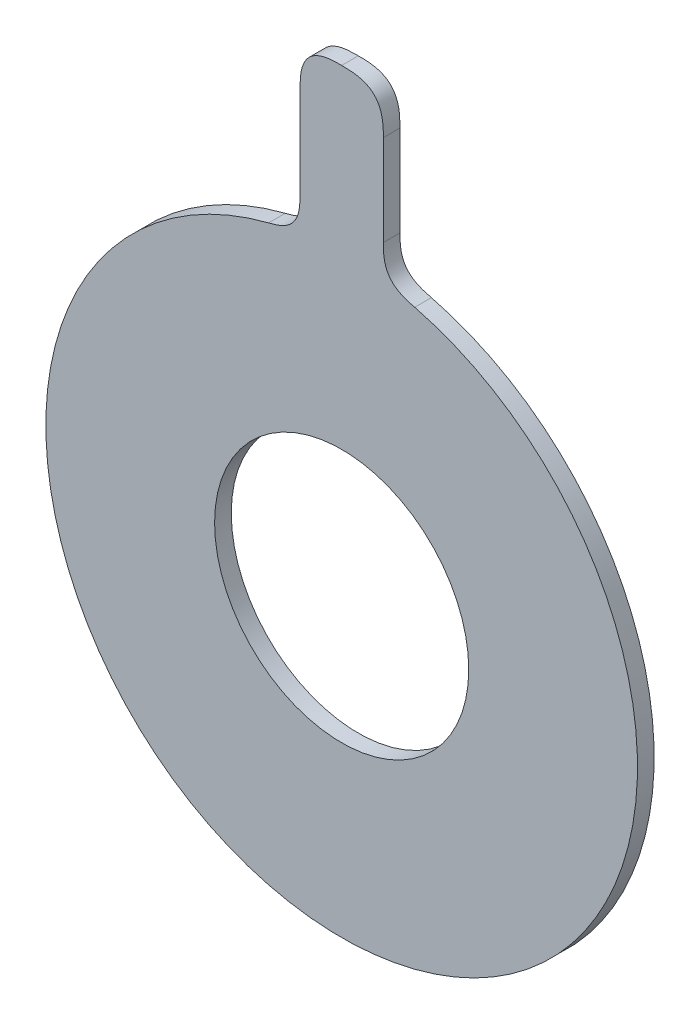
ISO-10303-21;
HEADER;
FILE_DESCRIPTION(('STEP AP214'),'2;1');
FILE_NAME('part.step','',(''),(''),'','','');
FILE_SCHEMA(('AUTOMOTIVE_DESIGN { 1 0 10303 214 1 1 1 1 }'));
ENDSEC;
DATA;
#1=APPLICATION_CONTEXT('core data for automotive mechanical design processes');
#2=APPLICATION_PROTOCOL_DEFINITION('international standard','automotive_design',2000,#1);
#3=PRODUCT_CONTEXT('',#1,'mechanical');
#4=PRODUCT('Part','Part','',(#3));
#5=PRODUCT_RELATED_PRODUCT_CATEGORY('part','',(#4));
#6=PRODUCT_DEFINITION_FORMATION('','',#4);
#7=PRODUCT_DEFINITION_CONTEXT('part definition',#1,'design');
#8=PRODUCT_DEFINITION('design','',#6,#7);
#9=PRODUCT_DEFINITION_SHAPE('','',#8);
#10=(LENGTH_UNIT() NAMED_UNIT(*) SI_UNIT(.MILLI.,.METRE.));
#11=(NAMED_UNIT(*) PLANE_ANGLE_UNIT() SI_UNIT($,.RADIAN.));
#12=(NAMED_UNIT(*) SI_UNIT($,.STERADIAN.) SOLID_ANGLE_UNIT());
#13=UNCERTAINTY_MEASURE_WITH_UNIT(LENGTH_MEASURE(1.E-05),#10,'distance_accuracy_value','');
#14=(GEOMETRIC_REPRESENTATION_CONTEXT(3) GLOBAL_UNCERTAINTY_ASSIGNED_CONTEXT((#13)) GLOBAL_UNIT_ASSIGNED_CONTEXT((#10,
#11,#12)) REPRESENTATION_CONTEXT('',''));
#15=CARTESIAN_POINT('',(0.,0.,0.));
#16=DIRECTION('',(0.,0.,1.));
#17=DIRECTION('',(1.,0.,0.));
#18=AXIS2_PLACEMENT_3D('',#15,#16,#17);
#19=CARTESIAN_POINT('',(0.,2.22044604925031E-13,2.));
#20=DIRECTION('',(0.,0.,-1.));
#21=DIRECTION('',(-1.,0.,0.));
#22=AXIS2_PLACEMENT_3D('',#19,#20,#21);
#23=CYLINDRICAL_SURFACE('',#22,35.5);
#24=CARTESIAN_POINT('',(0.,2.22044604925031E-13,2.));
#25=DIRECTION('',(0.,0.,1.));
#26=DIRECTION('',(1.,0.,0.));
#27=AXIS2_PLACEMENT_3D('',#24,#25,#26);
#28=CIRCLE('',#27,35.5);
#29=CARTESIAN_POINT('',(-8.76543209876557,34.4008313870746,2.00000000000045));
#30=VERTEX_POINT('',#29);
#31=CARTESIAN_POINT('',(8.76543209876512,34.4008313870744,2.));
#32=VERTEX_POINT('',#31);
#33=EDGE_CURVE('E171',#30,#32,#28,.T.);
#34=ORIENTED_EDGE('',*,*,#33,.F.);
#35=CARTESIAN_POINT('',(-8.76543209876554,34.4008313870747,-0.0999999999995449));
#36=CARTESIAN_POINT('',(-8.76543209876555,34.4008313870747,0.633333333333819));
#37=CARTESIAN_POINT('',(-8.76543209876557,34.4008313870747,1.36666666666752));
#38=CARTESIAN_POINT('',(-8.76543209876553,34.4008313870746,2.09999999999816));
#39=B_SPLINE_CURVE_WITH_KNOTS('',3,(#35,#36,#37,#38),.UNSPECIFIED.,.F.,.F.,(4,4),
(-9.99999999999998E-05,0.0021),.UNSPECIFIED.);
#40=CARTESIAN_POINT('',(-8.76543209876555,34.4008313870747,4.44089209850063E-13));
#41=VERTEX_POINT('',#40);
#42=EDGE_CURVE('E421',#30,#41,#39,.F.);
#43=ORIENTED_EDGE('',*,*,#42,.T.);
#44=CARTESIAN_POINT('',(0.,0.,0.));
#45=DIRECTION('',(0.,0.,1.));
#46=DIRECTION('',(1.,0.,0.));
#47=AXIS2_PLACEMENT_3D('',#44,#45,#46);
#48=CIRCLE('',#47,35.5);
#49=CARTESIAN_POINT('',(8.76543209876521,34.4008313870745,0.));
#50=VERTEX_POINT('',#49);
#51=EDGE_CURVE('E156',#41,#50,#48,.T.);
#52=ORIENTED_EDGE('',*,*,#51,.T.);
#53=CARTESIAN_POINT('',(8.76543209876518,34.4008313870744,2.0999999999986));
#54=CARTESIAN_POINT('',(8.76543209876512,34.4008313870745,1.36666666666707));
#55=CARTESIAN_POINT('',(8.76543209876521,34.4008313870745,0.633333333333375));
#56=CARTESIAN_POINT('',(8.76543209876515,34.4008313870745,-0.099999999999989));
#57=B_SPLINE_CURVE_WITH_KNOTS('',3,(#53,#54,#55,#56),.UNSPECIFIED.,.F.,.F.,(4,4),(-0.0001,
0.0021),.UNSPECIFIED.);
#58=EDGE_CURVE('E71',#50,#32,#57,.F.);
#59=ORIENTED_EDGE('',*,*,#58,.T.);
#60=EDGE_LOOP('',(#34,#43,#52,#59));
#61=FACE_BOUND('',#60,.T.);
#62=ADVANCED_FACE('F40',(#61),#23,.T.);
#63=CARTESIAN_POINT('',(0.,2.22044604925031E-13,2.));
#64=DIRECTION('',(0.,0.,1.));
#65=DIRECTION('',(1.,0.,0.));
#66=AXIS2_PLACEMENT_3D('',#63,#64,#65);
#67=PLANE('',#66);
#68=DIRECTION('',(0.,1.,0.));
#69=VECTOR('',#68,1.);
#70=CARTESIAN_POINT('',(4.99999999999939,35.1461235415802,2.00000000000033));
#71=LINE('',#70,#69);
#72=CARTESIAN_POINT('',(4.99999999999987,39.246018906381,2.00000000000011));
#73=VERTEX_POINT('',#72);
#74=CARTESIAN_POINT('',(4.99999999999984,50.1461235415829,2.));
#75=VERTEX_POINT('',#74);
#76=EDGE_CURVE('E129',#73,#75,#71,.T.);
#77=ORIENTED_EDGE('',*,*,#76,.T.);
#78=CARTESIAN_POINT('',(-1.53646452352103E-12,55.1461235415829,1.9999999999989));
#79=CARTESIAN_POINT('',(0.840990257668321,55.146123541582,1.9999999999989));
#80=CARTESIAN_POINT('',(1.68198051533819,55.1461235415804,1.99999999999882));
#81=CARTESIAN_POINT('',(3.53553390593263,54.7876639424003,1.99999999999879));
#82=CARTESIAN_POINT('',(4.64154040081864,53.6816574475131,1.99999999999875));
#83=CARTESIAN_POINT('',(4.99999999999973,51.8281040569224,1.99999999999874));
#84=CARTESIAN_POINT('',(4.99999999999938,50.9871137992527,1.99999999999874));
#85=CARTESIAN_POINT('',(4.99999999999985,50.1461235415829,1.99999999999879));
#86=B_SPLINE_CURVE_WITH_KNOTS('',5,(#78,#79,#80,#81,#82,#83,#84,#85),.UNSPECIFIED.,.F.,.F.,(6,2,
6),(0.,0.5,1.),.UNSPECIFIED.);
#87=CARTESIAN_POINT('',(-1.4883927423881E-12,55.1461235415829,2.00000000000011));
#88=VERTEX_POINT('',#87);
#89=EDGE_CURVE('E62',#75,#88,#86,.F.);
#90=ORIENTED_EDGE('',*,*,#89,.T.);
#91=CARTESIAN_POINT('',(-4.99999999999991,50.1461235415822,1.99999999999846));
#92=CARTESIAN_POINT('',(-5.00000000000038,50.9871137992519,1.99999999999846));
#93=CARTESIAN_POINT('',(-5.00000000000051,51.8281040569217,1.99999999999847));
#94=CARTESIAN_POINT('',(-4.6415404008205,53.6816574475159,1.99999999999851));
#95=CARTESIAN_POINT('',(-3.53553390593316,54.7876639424019,1.99999999999847));
#96=CARTESIAN_POINT('',(-1.68198051534068,55.1461235415829,1.99999999999914));
#97=CARTESIAN_POINT('',(-0.840990257671352,55.1461235415831,1.99999999999882));
#98=CARTESIAN_POINT('',(-1.53646452352103E-12,55.1461235415829,1.9999999999989));
#99=B_SPLINE_CURVE_WITH_KNOTS('',5,(#91,#92,#93,#94,#95,#96,#97,#98),.UNSPECIFIED.,.F.,.F.,(6,2,
6),(0.,0.5,1.),.UNSPECIFIED.);
#100=CARTESIAN_POINT('',(-4.99999999999995,50.1461235415822,2.00000000000045));
#101=VERTEX_POINT('',#100);
#102=EDGE_CURVE('E178',#88,#101,#99,.F.);
#103=ORIENTED_EDGE('',*,*,#102,.T.);
#104=DIRECTION('',(0.,-1.,0.));
#105=VECTOR('',#104,1.);
#106=CARTESIAN_POINT('',(-5.00000000000039,35.1461235415809,2.00000000000045));
#107=LINE('',#106,#105);
#108=CARTESIAN_POINT('',(-5.00000000000028,39.2460189063817,2.00000000000045));
#109=VERTEX_POINT('',#108);
#110=EDGE_CURVE('E140',#101,#109,#107,.T.);
#111=ORIENTED_EDGE('',*,*,#110,.T.);
#112=CARTESIAN_POINT('',(-8.76543209876553,34.4008313870746,1.99999999999846));
#113=CARTESIAN_POINT('',(-8.14815903699597,34.5581143622581,1.99999999999847));
#114=CARTESIAN_POINT('',(-7.50623307055207,34.7069349955398,1.99999999999845));
#115=CARTESIAN_POINT('',(-6.03905587624584,35.323981186758,1.99999999999847));
#116=CARTESIAN_POINT('',(-5.22960509826433,36.4057303778186,1.99999999999847));
#117=CARTESIAN_POINT('',(-4.99999999999993,37.8916576407777,1.99999999999851));
#118=CARTESIAN_POINT('',(-5.0000000000013,38.5688382735797,1.99999999999846));
#119=CARTESIAN_POINT('',(-5.00000000000034,39.2460189063817,1.99999999999852));
#120=B_SPLINE_CURVE_WITH_KNOTS('',5,(#112,#113,#114,#115,#116,#117,#118,#119),.UNSPECIFIED.,.F.,
.F.,(6,2,6),(0.,0.5,1.),.UNSPECIFIED.);
#121=EDGE_CURVE('E118',#109,#30,#120,.F.);
#122=ORIENTED_EDGE('',*,*,#121,.T.);
#123=ORIENTED_EDGE('',*,*,#33,.T.);
#124=CARTESIAN_POINT('',(4.99999999999986,39.246018906381,1.9999999999988));
#125=CARTESIAN_POINT('',(4.9999999999984,38.568838273579,1.9999999999988));
#126=CARTESIAN_POINT('',(4.99999999999986,37.8916576407771,1.99999999999893));
#127=CARTESIAN_POINT('',(5.22960509826383,36.4057303778193,1.99999999999912));
#128=CARTESIAN_POINT('',(6.03905587624529,35.3239811867576,1.9999999999989));
#129=CARTESIAN_POINT('',(7.50623307055017,34.7069349955418,1.99999999999885));
#130=CARTESIAN_POINT('',(8.14815903699486,34.5581143622582,1.99999999999874));
#131=CARTESIAN_POINT('',(8.76543209876517,34.4008313870744,1.99999999999879));
#132=B_SPLINE_CURVE_WITH_KNOTS('',5,(#124,#125,#126,#127,#128,#129,#130,#131),.UNSPECIFIED.,.F.,
.F.,(6,2,6),(0.,0.5,1.),.UNSPECIFIED.);
#133=EDGE_CURVE('E11',#32,#73,#132,.F.);
#134=ORIENTED_EDGE('',*,*,#133,.T.);
#135=EDGE_LOOP('',(#77,#90,#103,#111,#122,#123,#134));
#136=FACE_BOUND('',#135,.T.);
#137=CARTESIAN_POINT('',(0.,2.22044604925031E-13,2.));
#138=DIRECTION('',(0.,0.,1.));
#139=DIRECTION('',(1.,0.,0.));
#140=AXIS2_PLACEMENT_3D('',#137,#138,#139);
#141=CIRCLE('',#140,15.25);
#142=CARTESIAN_POINT('',(15.25,2.23102783908205E-13,2.));
#143=VERTEX_POINT('',#142);
#144=EDGE_CURVE('E162',#143,#143,#141,.T.);
#145=ORIENTED_EDGE('',*,*,#144,.F.);
#146=EDGE_LOOP('',(#145));
#147=FACE_BOUND('',#146,.T.);
#148=ADVANCED_FACE('F184',(#136,#147),#67,.T.);
#149=CARTESIAN_POINT('',(0.,0.,0.));
#150=DIRECTION('',(0.,0.,1.));
#151=DIRECTION('',(1.,0.,0.));
#152=AXIS2_PLACEMENT_3D('',#149,#150,#151);
#153=PLANE('',#152);
#154=CARTESIAN_POINT('',(-1.07456670241947E-12,55.1461235415829,1.26187580350157E-13));
#155=CARTESIAN_POINT('',(-0.84099025767089,55.1461235415831,1.54431046943404E-13));
#156=CARTESIAN_POINT('',(-1.68198051534032,55.146123541583,4.5923415894697E-13));
#157=CARTESIAN_POINT('',(-3.53553390593313,54.787663942402,4.59837246405415E-13));
#158=CARTESIAN_POINT('',(-4.64154040082047,53.6816574475159,4.72976421483223E-13));
#159=CARTESIAN_POINT('',(-5.00000000000043,51.8281040569217,4.59837246405415E-13));
#160=CARTESIAN_POINT('',(-5.00000000000089,50.9871137992519,5.69531401206635E-13));
#161=CARTESIAN_POINT('',(-4.99999999999992,50.1461235415822,4.72976421483223E-13));
#162=B_SPLINE_CURVE_WITH_KNOTS('',5,(#154,#155,#156,#157,#158,#159,#160,#161),.UNSPECIFIED.,.F.,
.F.,(6,2,6),(0.,0.5,1.),.UNSPECIFIED.);
#163=CARTESIAN_POINT('',(-4.99999999999988,50.1461235415822,4.44089209850063E-13));
#164=VERTEX_POINT('',#163);
#165=CARTESIAN_POINT('',(-1.07205910815367E-12,55.1461235415829,1.11022302462516E-13));
#166=VERTEX_POINT('',#165);
#167=EDGE_CURVE('E174',#164,#166,#162,.F.);
#168=ORIENTED_EDGE('',*,*,#167,.T.);
#169=CARTESIAN_POINT('',(4.99999999999987,50.1461235415829,0.));
#170=CARTESIAN_POINT('',(4.99999999999939,50.9871137992527,0.));
#171=CARTESIAN_POINT('',(4.99999999999983,51.8281040569224,0.));
#172=CARTESIAN_POINT('',(4.64154040081865,53.6816574475131,0.));
#173=CARTESIAN_POINT('',(3.53553390593265,54.7876639424002,0.));
#174=CARTESIAN_POINT('',(1.68198051533851,55.1461235415805,1.26838101653648E-13));
#175=CARTESIAN_POINT('',(0.840990257668693,55.1461235415821,2.22749336337147E-13));
#176=CARTESIAN_POINT('',(-1.07456670241947E-12,55.1461235415829,1.26187580350157E-13));
#177=B_SPLINE_CURVE_WITH_KNOTS('',5,(#169,#170,#171,#172,#173,#174,#175,#176),.UNSPECIFIED.,.F.,
.F.,(6,2,6),(0.,0.5,1.),.UNSPECIFIED.);
#178=CARTESIAN_POINT('',(4.99999999999992,50.1461235415829,0.));
#179=VERTEX_POINT('',#178);
#180=EDGE_CURVE('E132',#166,#179,#177,.F.);
#181=ORIENTED_EDGE('',*,*,#180,.T.);
#182=DIRECTION('',(0.,1.,0.));
#183=VECTOR('',#182,1.);
#184=CARTESIAN_POINT('',(4.99999999999987,35.1461235415802,3.33066907387547E-13));
#185=LINE('',#184,#183);
#186=CARTESIAN_POINT('',(4.99999999999992,39.246018906381,1.11022302462516E-13));
#187=VERTEX_POINT('',#186);
#188=EDGE_CURVE('E127',#187,#179,#185,.T.);
#189=ORIENTED_EDGE('',*,*,#188,.F.);
#190=CARTESIAN_POINT('',(8.76543209876516,34.4008313870745,0.));
#191=CARTESIAN_POINT('',(8.1481590369949,34.5581143622582,0.));
#192=CARTESIAN_POINT('',(7.50623307055016,34.7069349955419,2.22749336337147E-13));
#193=CARTESIAN_POINT('',(6.03905587624535,35.3239811867576,2.22749336337147E-13));
#194=CARTESIAN_POINT('',(5.22960509826289,36.4057303778194,3.48232185275188E-13));
#195=CARTESIAN_POINT('',(4.99999999999989,37.8916576407771,3.48211856484454E-13));
#196=CARTESIAN_POINT('',(4.99999999999848,38.568838273579,1.26180804086579E-13));
#197=CARTESIAN_POINT('',(4.99999999999992,39.246018906381,1.26180804086579E-13));
#198=B_SPLINE_CURVE_WITH_KNOTS('',5,(#190,#191,#192,#193,#194,#195,#196,#197),.UNSPECIFIED.,.F.,
.F.,(6,2,6),(0.,0.5,1.),.UNSPECIFIED.);
#199=EDGE_CURVE('E55',#187,#50,#198,.F.);
#200=ORIENTED_EDGE('',*,*,#199,.T.);
#201=ORIENTED_EDGE('',*,*,#51,.F.);
#202=CARTESIAN_POINT('',(-5.00000000000025,39.2460189063816,4.59844022668993E-13));
#203=CARTESIAN_POINT('',(-5.00000000000131,38.5688382735797,4.72976421483223E-13));
#204=CARTESIAN_POINT('',(-4.9999999999999,37.8916576407777,4.59166396311189E-13));
#205=CARTESIAN_POINT('',(-5.22960509826571,36.4057303778187,4.59837246405415E-13));
#206=CARTESIAN_POINT('',(-6.03905587624576,35.3239811867581,4.59837246405415E-13));
#207=CARTESIAN_POINT('',(-7.50623307055199,34.7069349955399,4.58515875007698E-13));
#208=CARTESIAN_POINT('',(-8.14815903699598,34.5581143622581,4.59837246405415E-13));
#209=CARTESIAN_POINT('',(-8.76543209876554,34.4008313870747,4.59159620047611E-13));
#210=B_SPLINE_CURVE_WITH_KNOTS('',5,(#202,#203,#204,#205,#206,#207,#208,#209),.UNSPECIFIED.,.F.,
.F.,(6,2,6),(0.,0.5,1.),.UNSPECIFIED.);
#211=CARTESIAN_POINT('',(-5.00000000000031,39.2460189063817,4.44089209850063E-13));
#212=VERTEX_POINT('',#211);
#213=EDGE_CURVE('E328',#41,#212,#210,.F.);
#214=ORIENTED_EDGE('',*,*,#213,.T.);
#215=DIRECTION('',(0.,-1.,0.));
#216=VECTOR('',#215,1.);
#217=CARTESIAN_POINT('',(-4.99999999999992,35.1461235415809,4.44089209850063E-13));
#218=LINE('',#217,#216);
#219=EDGE_CURVE('E141',#164,#212,#218,.T.);
#220=ORIENTED_EDGE('',*,*,#219,.F.);
#221=EDGE_LOOP('',(#168,#181,#189,#200,#201,#214,#220));
#222=FACE_BOUND('',#221,.T.);
#223=CARTESIAN_POINT('',(0.,0.,0.));
#224=DIRECTION('',(0.,0.,1.));
#225=DIRECTION('',(1.,0.,0.));
#226=AXIS2_PLACEMENT_3D('',#223,#224,#225);
#227=CIRCLE('',#226,15.25);
#228=CARTESIAN_POINT('',(15.25,0.,0.));
#229=VERTEX_POINT('',#228);
#230=EDGE_CURVE('E166',#229,#229,#227,.T.);
#231=ORIENTED_EDGE('',*,*,#230,.T.);
#232=EDGE_LOOP('',(#231));
#233=FACE_BOUND('',#232,.T.);
#234=ADVANCED_FACE('F135',(#222,#233),#153,.F.);
#235=CARTESIAN_POINT('',(0.,2.22044604925031E-13,2.));
#236=DIRECTION('',(0.,0.,-1.));
#237=DIRECTION('',(-1.,0.,0.));
#238=AXIS2_PLACEMENT_3D('',#235,#236,#237);
#239=CYLINDRICAL_SURFACE('',#238,15.25);
#240=ORIENTED_EDGE('',*,*,#144,.T.);
#241=EDGE_LOOP('',(#240));
#242=FACE_BOUND('',#241,.T.);
#243=ORIENTED_EDGE('',*,*,#230,.F.);
#244=EDGE_LOOP('',(#243));
#245=FACE_BOUND('',#244,.T.);
#246=ADVANCED_FACE('F194',(#242,#245),#239,.F.);
#247=CARTESIAN_POINT('',(-5.00000000000039,35.1461235415809,2.00000000000045));
#248=DIRECTION('',(1.,0.,0.));
#249=DIRECTION('',(0.,0.,-1.));
#250=AXIS2_PLACEMENT_3D('',#247,#248,#249);
#251=PLANE('',#250);
#252=ORIENTED_EDGE('',*,*,#110,.F.);
#253=CARTESIAN_POINT('',(-4.99999999999992,50.1461235415822,-0.0999999999995449));
#254=CARTESIAN_POINT('',(-4.99999999999994,50.1461235415822,0.63333333333393));
#255=CARTESIAN_POINT('',(-4.99999999999989,50.1461235415822,1.36666666666752));
#256=CARTESIAN_POINT('',(-4.99999999999991,50.1461235415822,2.09999999999816));
#257=B_SPLINE_CURVE_WITH_KNOTS('',3,(#253,#254,#255,#256),.UNSPECIFIED.,.F.,.F.,(4,4),
(-9.99999999999998E-05,0.0021),.UNSPECIFIED.);
#258=EDGE_CURVE('E306',#101,#164,#257,.F.);
#259=ORIENTED_EDGE('',*,*,#258,.T.);
#260=ORIENTED_EDGE('',*,*,#219,.T.);
#261=CARTESIAN_POINT('',(-5.00000000000034,39.2460189063817,2.09999999999821));
#262=CARTESIAN_POINT('',(-5.00000000000034,39.2460189063817,1.36666666666763));
#263=CARTESIAN_POINT('',(-5.00000000000025,39.2460189063817,0.633333333333819));
#264=CARTESIAN_POINT('',(-5.00000000000025,39.2460189063816,-0.0999999999995449));
#265=B_SPLINE_CURVE_WITH_KNOTS('',3,(#261,#262,#263,#264),.UNSPECIFIED.,.F.,.F.,(4,4),(-0.0001,
0.0021),.UNSPECIFIED.);
#266=EDGE_CURVE('E367',#212,#109,#265,.F.);
#267=ORIENTED_EDGE('',*,*,#266,.T.);
#268=EDGE_LOOP('',(#252,#259,#260,#267));
#269=FACE_BOUND('',#268,.T.);
#270=ADVANCED_FACE('F436',(#269),#251,.F.);
#271=CARTESIAN_POINT('',(4.99999999999939,35.1461235415802,2.00000000000033));
#272=DIRECTION('',(-1.,0.,0.));
#273=DIRECTION('',(0.,-1.,0.));
#274=AXIS2_PLACEMENT_3D('',#271,#272,#273);
#275=PLANE('',#274);
#276=ORIENTED_EDGE('',*,*,#188,.T.);
#277=CARTESIAN_POINT('',(4.99999999999984,50.1461235415829,2.0999999999986));
#278=CARTESIAN_POINT('',(4.99999999999989,50.1461235415829,1.36666666666707));
#279=CARTESIAN_POINT('',(4.99999999999987,50.1461235415829,0.633333333333375));
#280=CARTESIAN_POINT('',(4.99999999999987,50.1461235415829,-0.099999999999989));
#281=B_SPLINE_CURVE_WITH_KNOTS('',3,(#277,#278,#279,#280),.UNSPECIFIED.,.F.,.F.,(4,4),(-0.0001,
0.0021),.UNSPECIFIED.);
#282=EDGE_CURVE('E131',#179,#75,#281,.F.);
#283=ORIENTED_EDGE('',*,*,#282,.T.);
#284=ORIENTED_EDGE('',*,*,#76,.F.);
#285=CARTESIAN_POINT('',(4.99999999999992,39.246018906381,-0.099999999999878));
#286=CARTESIAN_POINT('',(4.99999999999987,39.246018906381,0.633333333333486));
#287=CARTESIAN_POINT('',(4.99999999999987,39.246018906381,1.36666666666718));
#288=CARTESIAN_POINT('',(4.99999999999987,39.246018906381,2.0999999999986));
#289=B_SPLINE_CURVE_WITH_KNOTS('',3,(#285,#286,#287,#288),.UNSPECIFIED.,.F.,.F.,(4,4),
(-9.99999999999998E-05,0.0021),.UNSPECIFIED.);
#290=EDGE_CURVE('E111',#73,#187,#289,.F.);
#291=ORIENTED_EDGE('',*,*,#290,.T.);
#292=EDGE_LOOP('',(#276,#283,#284,#291));
#293=FACE_BOUND('',#292,.T.);
#294=ADVANCED_FACE('F125',(#293),#275,.F.);
#295=CARTESIAN_POINT('',(-4.99999999999991,50.1461235415822,2.09999999999816));
#296=CARTESIAN_POINT('',(-4.99999999999989,50.1461235415822,1.36666666666752));
#297=CARTESIAN_POINT('',(-4.99999999999994,50.1461235415822,0.63333333333393));
#298=CARTESIAN_POINT('',(-4.99999999999992,50.1461235415822,-0.0999999999995449));
#299=CARTESIAN_POINT('',(-5.00000000000037,50.9871137992519,2.09999999999816));
#300=CARTESIAN_POINT('',(-5.00000000000048,50.9871137992519,1.36666666666752));
#301=CARTESIAN_POINT('',(-5.00000000000084,50.9871137992519,0.63333333333393));
#302=CARTESIAN_POINT('',(-5.00000000000089,50.9871137992519,-0.0999999999994339));
#303=CARTESIAN_POINT('',(-5.00000000000051,51.8281040569217,2.09999999999816));
#304=CARTESIAN_POINT('',(-5.00000000000051,51.8281040569217,1.36666666666763));
#305=CARTESIAN_POINT('',(-5.00000000000043,51.8281040569217,0.633333333333819));
#306=CARTESIAN_POINT('',(-5.00000000000043,51.8281040569217,-0.0999999999995449));
#307=CARTESIAN_POINT('',(-4.6415404008205,53.6816574475159,2.09999999999821));
#308=CARTESIAN_POINT('',(-4.6415404008205,53.6816574475159,1.36666666666752));
#309=CARTESIAN_POINT('',(-4.64154040082047,53.6816574475159,0.63333333333393));
#310=CARTESIAN_POINT('',(-4.64154040082047,53.6816574475159,-0.0999999999995449));
#311=CARTESIAN_POINT('',(-3.53553390593316,54.7876639424019,2.09999999999816));
#312=CARTESIAN_POINT('',(-3.53553390593316,54.7876639424019,1.36666666666763));
#313=CARTESIAN_POINT('',(-3.53553390593308,54.7876639424019,0.633333333333819));
#314=CARTESIAN_POINT('',(-3.53553390593314,54.787663942402,-0.0999999999995449));
#315=CARTESIAN_POINT('',(-1.68198051534068,55.1461235415829,2.09999999999894));
#316=CARTESIAN_POINT('',(-1.68198051534068,55.146123541583,1.36666666666752));
#317=CARTESIAN_POINT('',(-1.6819805153407,55.146123541583,0.633333333333819));
#318=CARTESIAN_POINT('',(-1.68198051534026,55.146123541583,-0.0999999999995449));
#319=CARTESIAN_POINT('',(-0.84099025767136,55.1461235415831,2.0999999999986));
#320=CARTESIAN_POINT('',(-0.840990257671304,55.1461235415831,1.36666666666729));
#321=CARTESIAN_POINT('',(-0.840990257671276,55.1461235415831,0.633333333333708));
#322=CARTESIAN_POINT('',(-0.840990257670832,55.1461235415831,-0.099999999999878));
#323=CARTESIAN_POINT('',(-1.54390389361936E-12,55.1461235415829,2.09999999999871));
#324=CARTESIAN_POINT('',(-1.4883927423881E-12,55.1461235415829,1.36666666666718));
#325=CARTESIAN_POINT('',(-1.46063716677247E-12,55.1461235415829,0.633333333333486));
#326=CARTESIAN_POINT('',(-1.01654795692241E-12,55.1461235415829,-0.099999999999878));
#327=B_SPLINE_SURFACE_WITH_KNOTS('',5,3,((#295,#296,#297,#298),(#299,#300,#301,#302),(#303,#304,
#305,#306),(#307,#308,#309,#310),(#311,#312,#313,#314),(#315,#316,#317,#318),(#319,#320,#321,
#322),(#323,#324,#325,#326)),.UNSPECIFIED.,.F.,.F.,.F.,(6,2,6),(4,4),(0.,0.5,1.),(-0.0001,
0.0021),.UNSPECIFIED.);
#328=CARTESIAN_POINT('',(-1.01654795692241E-12,55.1461235415829,-0.099999999999878));
#329=CARTESIAN_POINT('',(-1.46063716677247E-12,55.1461235415829,0.633333333333486));
#330=CARTESIAN_POINT('',(-1.4883927423881E-12,55.1461235415829,1.36666666666718));
#331=CARTESIAN_POINT('',(-1.54390389361936E-12,55.1461235415829,2.09999999999871));
#332=B_SPLINE_CURVE_WITH_KNOTS('',3,(#328,#329,#330,#331),.UNSPECIFIED.,.F.,.F.,(4,4),
(-9.99999999999998E-05,0.0021),.UNSPECIFIED.);
#333=EDGE_CURVE('E149',#166,#88,#332,.T.);
#334=ORIENTED_EDGE('',*,*,#258,.F.);
#335=ORIENTED_EDGE('',*,*,#102,.F.);
#336=ORIENTED_EDGE('',*,*,#333,.F.);
#337=ORIENTED_EDGE('',*,*,#167,.F.);
#338=EDGE_LOOP('',(#334,#335,#336,#337));
#339=FACE_BOUND('',#338,.T.);
#340=ADVANCED_FACE('F256',(#339),#327,.T.);
#341=CARTESIAN_POINT('',(-1.54390389361936E-12,55.1461235415829,2.09999999999871));
#342=CARTESIAN_POINT('',(-1.4883927423881E-12,55.1461235415829,1.36666666666718));
#343=CARTESIAN_POINT('',(-1.46063716677247E-12,55.1461235415829,0.633333333333486));
#344=CARTESIAN_POINT('',(-1.01654795692241E-12,55.1461235415829,-0.099999999999878));
#345=CARTESIAN_POINT('',(0.840990257668327,55.146123541582,2.09999999999871));
#346=CARTESIAN_POINT('',(0.840990257668272,55.1461235415822,1.36666666666718));
#347=CARTESIAN_POINT('',(0.840990257668355,55.1461235415822,0.633333333333486));
#348=CARTESIAN_POINT('',(0.840990257668744,55.1461235415821,-0.0999999999997669));
#349=CARTESIAN_POINT('',(1.6819805153382,55.1461235415804,2.0999999999986));
#350=CARTESIAN_POINT('',(1.68198051533814,55.1461235415806,1.36666666666729));
#351=CARTESIAN_POINT('',(1.68198051533817,55.1461235415806,0.633333333333486));
#352=CARTESIAN_POINT('',(1.68198051533856,55.1461235415805,-0.099999999999878));
#353=CARTESIAN_POINT('',(3.53553390593264,54.7876639424003,2.0999999999986));
#354=CARTESIAN_POINT('',(3.53553390593259,54.7876639424002,1.36666666666707));
#355=CARTESIAN_POINT('',(3.5355339059327,54.7876639424003,0.633333333333375));
#356=CARTESIAN_POINT('',(3.53553390593264,54.7876639424002,-0.099999999999989));
#357=CARTESIAN_POINT('',(4.64154040081865,53.6816574475131,2.09999999999855));
#358=CARTESIAN_POINT('',(4.6415404008186,53.6816574475132,1.36666666666718));
#359=CARTESIAN_POINT('',(4.64154040081865,53.6816574475132,0.633333333333375));
#360=CARTESIAN_POINT('',(4.64154040081865,53.6816574475131,-0.099999999999989));
#361=CARTESIAN_POINT('',(4.99999999999973,51.8281040569224,2.09999999999855));
#362=CARTESIAN_POINT('',(4.99999999999973,51.8281040569224,1.36666666666707));
#363=CARTESIAN_POINT('',(4.99999999999978,51.8281040569224,0.633333333333375));
#364=CARTESIAN_POINT('',(4.99999999999983,51.8281040569224,-0.099999999999989));
#365=CARTESIAN_POINT('',(4.99999999999939,50.9871137992527,2.09999999999855));
#366=CARTESIAN_POINT('',(4.99999999999928,50.9871137992527,1.36666666666707));
#367=CARTESIAN_POINT('',(4.99999999999939,50.9871137992527,0.633333333333375));
#368=CARTESIAN_POINT('',(4.99999999999939,50.9871137992527,-0.099999999999989));
#369=CARTESIAN_POINT('',(4.99999999999984,50.1461235415829,2.0999999999986));
#370=CARTESIAN_POINT('',(4.99999999999989,50.1461235415829,1.36666666666707));
#371=CARTESIAN_POINT('',(4.99999999999987,50.1461235415829,0.633333333333375));
#372=CARTESIAN_POINT('',(4.99999999999987,50.1461235415829,-0.099999999999989));
#373=B_SPLINE_SURFACE_WITH_KNOTS('',5,3,((#341,#342,#343,#344),(#345,#346,#347,#348),(#349,#350,
#351,#352),(#353,#354,#355,#356),(#357,#358,#359,#360),(#361,#362,#363,#364),(#365,#366,#367,
#368),(#369,#370,#371,#372)),.UNSPECIFIED.,.F.,.F.,.F.,(6,2,6),(4,4),(0.,0.5,1.),(-0.0001,
0.0021),.UNSPECIFIED.);
#374=ORIENTED_EDGE('',*,*,#89,.F.);
#375=ORIENTED_EDGE('',*,*,#282,.F.);
#376=ORIENTED_EDGE('',*,*,#180,.F.);
#377=ORIENTED_EDGE('',*,*,#333,.T.);
#378=EDGE_LOOP('',(#374,#375,#376,#377));
#379=FACE_BOUND('',#378,.T.);
#380=ADVANCED_FACE('F241',(#379),#373,.T.);
#381=CARTESIAN_POINT('',(-8.76543209876553,34.4008313870746,2.09999999999816));
#382=CARTESIAN_POINT('',(-8.76543209876557,34.4008313870747,1.36666666666752));
#383=CARTESIAN_POINT('',(-8.76543209876555,34.4008313870747,0.633333333333819));
#384=CARTESIAN_POINT('',(-8.76543209876554,34.4008313870747,-0.0999999999995449));
#385=CARTESIAN_POINT('',(-8.14815903699597,34.5581143622581,2.09999999999816));
#386=CARTESIAN_POINT('',(-8.14815903699596,34.5581143622581,1.36666666666763));
#387=CARTESIAN_POINT('',(-8.14815903699595,34.5581143622581,0.633333333333819));
#388=CARTESIAN_POINT('',(-8.14815903699599,34.5581143622581,-0.0999999999995449));
#389=CARTESIAN_POINT('',(-7.50623307055208,34.7069349955398,2.09999999999816));
#390=CARTESIAN_POINT('',(-7.50623307055201,34.7069349955399,1.3666666666674));
#391=CARTESIAN_POINT('',(-7.50623307055205,34.7069349955399,0.633333333333819));
#392=CARTESIAN_POINT('',(-7.50623307055199,34.7069349955399,-0.0999999999995449));
#393=CARTESIAN_POINT('',(-6.03905587624585,35.3239811867579,2.09999999999816));
#394=CARTESIAN_POINT('',(-6.03905587624579,35.3239811867582,1.36666666666763));
#395=CARTESIAN_POINT('',(-6.03905587624571,35.3239811867582,0.633333333333819));
#396=CARTESIAN_POINT('',(-6.03905587624577,35.3239811867581,-0.0999999999995449));
#397=CARTESIAN_POINT('',(-5.22960509826431,36.4057303778186,2.09999999999816));
#398=CARTESIAN_POINT('',(-5.22960509826437,36.4057303778187,1.36666666666763));
#399=CARTESIAN_POINT('',(-5.22960509826567,36.4057303778187,0.633333333333819));
#400=CARTESIAN_POINT('',(-5.22960509826573,36.4057303778187,-0.0999999999995449));
#401=CARTESIAN_POINT('',(-4.99999999999992,37.8916576407777,2.09999999999821));
#402=CARTESIAN_POINT('',(-4.99999999999998,37.8916576407777,1.36666666666752));
#403=CARTESIAN_POINT('',(-4.9999999999999,37.8916576407777,0.633333333333819));
#404=CARTESIAN_POINT('',(-4.9999999999999,37.8916576407777,-0.0999999999995449));
#405=CARTESIAN_POINT('',(-5.00000000000129,38.5688382735797,2.09999999999816));
#406=CARTESIAN_POINT('',(-5.00000000000134,38.5688382735797,1.36666666666752));
#407=CARTESIAN_POINT('',(-5.00000000000132,38.5688382735797,0.63333333333393));
#408=CARTESIAN_POINT('',(-5.00000000000131,38.5688382735797,-0.0999999999995449));
#409=CARTESIAN_POINT('',(-5.00000000000034,39.2460189063817,2.09999999999821));
#410=CARTESIAN_POINT('',(-5.00000000000034,39.2460189063817,1.36666666666763));
#411=CARTESIAN_POINT('',(-5.00000000000025,39.2460189063817,0.633333333333819));
#412=CARTESIAN_POINT('',(-5.00000000000025,39.2460189063816,-0.0999999999995449));
#413=B_SPLINE_SURFACE_WITH_KNOTS('',5,3,((#381,#382,#383,#384),(#385,#386,#387,#388),(#389,#390,
#391,#392),(#393,#394,#395,#396),(#397,#398,#399,#400),(#401,#402,#403,#404),(#405,#406,#407,
#408),(#409,#410,#411,#412)),.UNSPECIFIED.,.F.,.F.,.F.,(6,2,6),(4,4),(0.,0.5,1.),(-0.0001,
0.0021),.UNSPECIFIED.);
#414=ORIENTED_EDGE('',*,*,#121,.F.);
#415=ORIENTED_EDGE('',*,*,#266,.F.);
#416=ORIENTED_EDGE('',*,*,#213,.F.);
#417=ORIENTED_EDGE('',*,*,#42,.F.);
#418=EDGE_LOOP('',(#414,#415,#416,#417));
#419=FACE_BOUND('',#418,.T.);
#420=ADVANCED_FACE('F255',(#419),#413,.T.);
#421=CARTESIAN_POINT('',(4.99999999999987,39.246018906381,2.0999999999986));
#422=CARTESIAN_POINT('',(4.99999999999987,39.246018906381,1.36666666666718));
#423=CARTESIAN_POINT('',(4.99999999999987,39.246018906381,0.633333333333486));
#424=CARTESIAN_POINT('',(4.99999999999992,39.246018906381,-0.099999999999878));
#425=CARTESIAN_POINT('',(4.99999999999839,38.568838273579,2.0999999999986));
#426=CARTESIAN_POINT('',(4.99999999999848,38.568838273579,1.36666666666718));
#427=CARTESIAN_POINT('',(4.99999999999848,38.5688382735791,0.633333333333486));
#428=CARTESIAN_POINT('',(4.99999999999848,38.568838273579,-0.099999999999878));
#429=CARTESIAN_POINT('',(4.99999999999987,37.8916576407771,2.09999999999871));
#430=CARTESIAN_POINT('',(4.99999999999986,37.8916576407771,1.3666666666674));
#431=CARTESIAN_POINT('',(4.99999999999989,37.8916576407771,0.633333333333708));
#432=CARTESIAN_POINT('',(4.99999999999989,37.8916576407771,-0.0999999999996559));
#433=CARTESIAN_POINT('',(5.22960509826384,36.4057303778193,2.09999999999894));
#434=CARTESIAN_POINT('',(5.22960509826378,36.4057303778194,1.3666666666674));
#435=CARTESIAN_POINT('',(5.22960509826284,36.4057303778194,0.633333333333708));
#436=CARTESIAN_POINT('',(5.2296050982629,36.4057303778194,-0.0999999999996559));
#437=CARTESIAN_POINT('',(6.03905587624529,35.3239811867576,2.09999999999871));
#438=CARTESIAN_POINT('',(6.03905587624534,35.3239811867576,1.36666666666718));
#439=CARTESIAN_POINT('',(6.0390558762454,35.3239811867576,0.633333333333486));
#440=CARTESIAN_POINT('',(6.03905587624534,35.3239811867576,-0.0999999999997669));
#441=CARTESIAN_POINT('',(7.50623307055017,34.7069349955418,2.09999999999866));
#442=CARTESIAN_POINT('',(7.50623307055015,34.7069349955419,1.36666666666718));
#443=CARTESIAN_POINT('',(7.50623307055021,34.7069349955419,0.633333333333486));
#444=CARTESIAN_POINT('',(7.50623307055015,34.7069349955419,-0.0999999999997669));
#445=CARTESIAN_POINT('',(8.14815903699486,34.5581143622582,2.09999999999855));
#446=CARTESIAN_POINT('',(8.14815903699486,34.5581143622582,1.36666666666707));
#447=CARTESIAN_POINT('',(8.1481590369949,34.5581143622582,0.633333333333375));
#448=CARTESIAN_POINT('',(8.1481590369949,34.5581143622582,-0.099999999999989));
#449=CARTESIAN_POINT('',(8.76543209876518,34.4008313870744,2.0999999999986));
#450=CARTESIAN_POINT('',(8.76543209876512,34.4008313870745,1.36666666666707));
#451=CARTESIAN_POINT('',(8.76543209876521,34.4008313870745,0.633333333333375));
#452=CARTESIAN_POINT('',(8.76543209876515,34.4008313870745,-0.099999999999989));
#453=B_SPLINE_SURFACE_WITH_KNOTS('',5,3,((#421,#422,#423,#424),(#425,#426,#427,#428),(#429,#430,
#431,#432),(#433,#434,#435,#436),(#437,#438,#439,#440),(#441,#442,#443,#444),(#445,#446,#447,
#448),(#449,#450,#451,#452)),.UNSPECIFIED.,.F.,.F.,.F.,(6,2,6),(4,4),(0.,0.5,1.),(-0.0001,
0.0021),.UNSPECIFIED.);
#454=ORIENTED_EDGE('',*,*,#133,.F.);
#455=ORIENTED_EDGE('',*,*,#58,.F.);
#456=ORIENTED_EDGE('',*,*,#199,.F.);
#457=ORIENTED_EDGE('',*,*,#290,.F.);
#458=EDGE_LOOP('',(#454,#455,#456,#457));
#459=FACE_BOUND('',#458,.T.);
#460=ADVANCED_FACE('F43',(#459),#453,.T.);
#461=CLOSED_SHELL('',(#62,#148,#234,#246,#270,#294,#340,#380,#420,#460));
#462=MANIFOLD_SOLID_BREP('B2',#461);
#463=ADVANCED_BREP_SHAPE_REPRESENTATION('',(#18,#462),#14);
#464=SHAPE_DEFINITION_REPRESENTATION(#9,#463);
ENDSEC;
END-ISO-10303-21;
